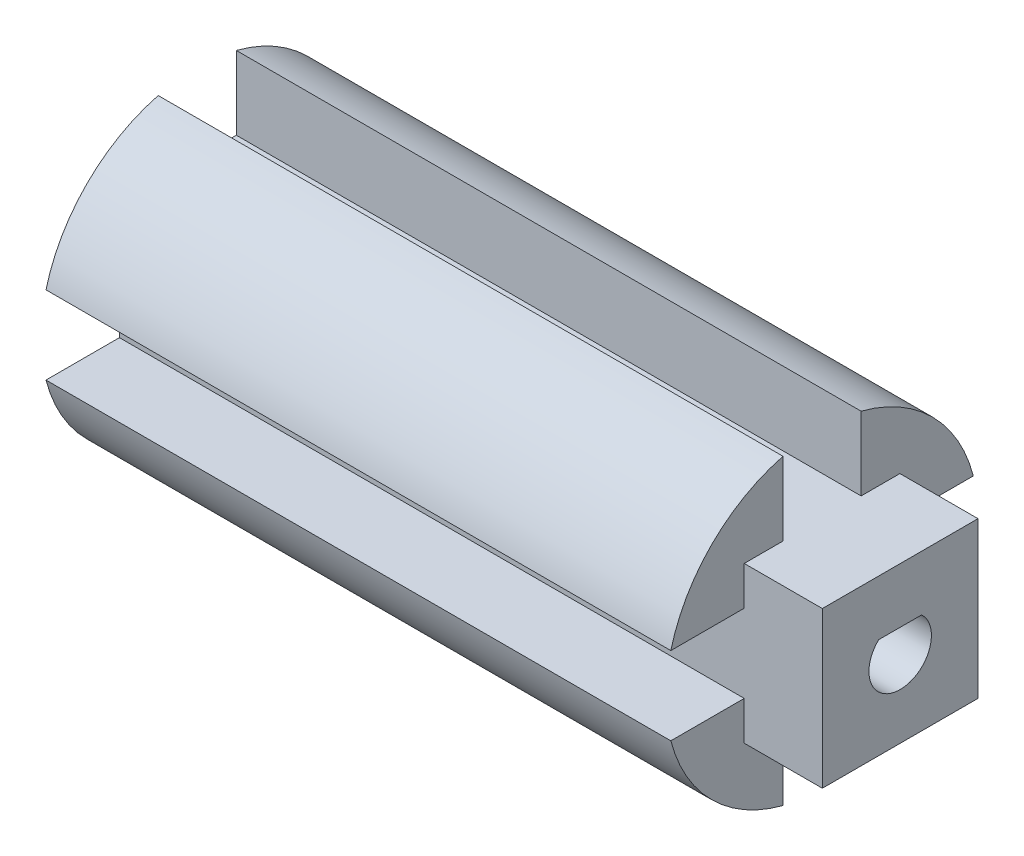
ISO-10303-21;
HEADER;
FILE_DESCRIPTION(('STEP AP214'),'2;1');
FILE_NAME('part.step','',(''),(''),'','','');
FILE_SCHEMA(('AUTOMOTIVE_DESIGN { 1 0 10303 214 1 1 1 1 }'));
ENDSEC;
DATA;
#1=APPLICATION_CONTEXT('core data for automotive mechanical design processes');
#2=APPLICATION_PROTOCOL_DEFINITION('international standard','automotive_design',2000,#1);
#3=PRODUCT_CONTEXT('',#1,'mechanical');
#4=PRODUCT('Part','Part','',(#3));
#5=PRODUCT_RELATED_PRODUCT_CATEGORY('part','',(#4));
#6=PRODUCT_DEFINITION_FORMATION('','',#4);
#7=PRODUCT_DEFINITION_CONTEXT('part definition',#1,'design');
#8=PRODUCT_DEFINITION('design','',#6,#7);
#9=PRODUCT_DEFINITION_SHAPE('','',#8);
#10=(LENGTH_UNIT() NAMED_UNIT(*) SI_UNIT(.MILLI.,.METRE.));
#11=(NAMED_UNIT(*) PLANE_ANGLE_UNIT() SI_UNIT($,.RADIAN.));
#12=(NAMED_UNIT(*) SI_UNIT($,.STERADIAN.) SOLID_ANGLE_UNIT());
#13=UNCERTAINTY_MEASURE_WITH_UNIT(LENGTH_MEASURE(1.E-05),#10,'distance_accuracy_value','');
#14=(GEOMETRIC_REPRESENTATION_CONTEXT(3) GLOBAL_UNCERTAINTY_ASSIGNED_CONTEXT((#13)) GLOBAL_UNIT_ASSIGNED_CONTEXT((#10,
#11,#12)) REPRESENTATION_CONTEXT('',''));
#15=CARTESIAN_POINT('',(0.,0.,0.));
#16=DIRECTION('',(0.,0.,1.));
#17=DIRECTION('',(1.,0.,0.));
#18=AXIS2_PLACEMENT_3D('',#15,#16,#17);
#19=CARTESIAN_POINT('',(90.,5.,0.));
#20=DIRECTION('',(0.,1.,0.));
#21=DIRECTION('',(0.,0.,1.));
#22=AXIS2_PLACEMENT_3D('',#19,#20,#21);
#23=PLANE('',#22);
#24=DIRECTION('',(0.,0.,-1.));
#25=VECTOR('',#24,1.);
#26=CARTESIAN_POINT('',(80.,5.,0.));
#27=LINE('',#26,#25);
#28=CARTESIAN_POINT('',(80.,5.,-9.96491673103709));
#29=VERTEX_POINT('',#28);
#30=CARTESIAN_POINT('',(80.,5.,-19.3649167310371));
#31=VERTEX_POINT('',#30);
#32=EDGE_CURVE('E199',#29,#31,#27,.T.);
#33=ORIENTED_EDGE('',*,*,#32,.F.);
#34=DIRECTION('',(-1.,0.,0.));
#35=VECTOR('',#34,1.);
#36=CARTESIAN_POINT('',(90.,5.,-9.96491673103709));
#37=LINE('',#36,#35);
#38=CARTESIAN_POINT('',(0.,5.,-9.96491673103709));
#39=VERTEX_POINT('',#38);
#40=EDGE_CURVE('E194',#29,#39,#37,.T.);
#41=ORIENTED_EDGE('',*,*,#40,.T.);
#42=DIRECTION('',(0.,0.,-1.));
#43=VECTOR('',#42,1.);
#44=CARTESIAN_POINT('',(0.,5.,0.));
#45=LINE('',#44,#43);
#46=CARTESIAN_POINT('',(0.,5.,-19.3649167310371));
#47=VERTEX_POINT('',#46);
#48=EDGE_CURVE('E302',#39,#47,#45,.T.);
#49=ORIENTED_EDGE('',*,*,#48,.T.);
#50=DIRECTION('',(-1.,0.,0.));
#51=VECTOR('',#50,1.);
#52=CARTESIAN_POINT('',(90.,5.,-19.3649167310371));
#53=LINE('',#52,#51);
#54=EDGE_CURVE('E11',#31,#47,#53,.T.);
#55=ORIENTED_EDGE('',*,*,#54,.F.);
#56=EDGE_LOOP('',(#33,#41,#49,#55));
#57=FACE_BOUND('',#56,.T.);
#58=ADVANCED_FACE('F40',(#57),#23,.F.);
#59=CARTESIAN_POINT('',(90.,0.,0.));
#60=DIRECTION('',(-1.,0.,0.));
#61=DIRECTION('',(0.,0.,1.));
#62=AXIS2_PLACEMENT_3D('',#59,#60,#61);
#63=CYLINDRICAL_SURFACE('',#62,20.);
#64=CARTESIAN_POINT('',(80.,0.,0.));
#65=DIRECTION('',(1.,0.,0.));
#66=DIRECTION('',(0.,0.,-1.));
#67=AXIS2_PLACEMENT_3D('',#64,#65,#66);
#68=CIRCLE('',#67,20.);
#69=CARTESIAN_POINT('',(80.,19.3649167310371,-5.));
#70=VERTEX_POINT('',#69);
#71=EDGE_CURVE('E225',#31,#70,#68,.T.);
#72=ORIENTED_EDGE('',*,*,#71,.F.);
#73=ORIENTED_EDGE('',*,*,#54,.T.);
#74=CARTESIAN_POINT('',(0.,0.,0.));
#75=DIRECTION('',(1.,0.,0.));
#76=DIRECTION('',(0.,0.,-1.));
#77=AXIS2_PLACEMENT_3D('',#74,#75,#76);
#78=CIRCLE('',#77,20.);
#79=CARTESIAN_POINT('',(0.,19.3649167310371,-5.));
#80=VERTEX_POINT('',#79);
#81=EDGE_CURVE('E319',#47,#80,#78,.T.);
#82=ORIENTED_EDGE('',*,*,#81,.T.);
#83=DIRECTION('',(-1.,0.,0.));
#84=VECTOR('',#83,1.);
#85=CARTESIAN_POINT('',(90.,19.3649167310371,-5.));
#86=LINE('',#85,#84);
#87=EDGE_CURVE('E48',#70,#80,#86,.T.);
#88=ORIENTED_EDGE('',*,*,#87,.F.);
#89=EDGE_LOOP('',(#72,#73,#82,#88));
#90=FACE_BOUND('',#89,.T.);
#91=ADVANCED_FACE('F417',(#90),#63,.T.);
#92=CARTESIAN_POINT('',(90.,0.,-5.));
#93=DIRECTION('',(0.,0.,1.));
#94=DIRECTION('',(0.,-1.,0.));
#95=AXIS2_PLACEMENT_3D('',#92,#93,#94);
#96=PLANE('',#95);
#97=DIRECTION('',(-1.,0.,0.));
#98=VECTOR('',#97,1.);
#99=CARTESIAN_POINT('',(90.,9.96491673103709,-5.));
#100=LINE('',#99,#98);
#101=CARTESIAN_POINT('',(80.,9.96491673103709,-5.));
#102=VERTEX_POINT('',#101);
#103=CARTESIAN_POINT('',(0.,9.96491673103709,-5.));
#104=VERTEX_POINT('',#103);
#105=EDGE_CURVE('E407',#102,#104,#100,.T.);
#106=ORIENTED_EDGE('',*,*,#105,.F.);
#107=DIRECTION('',(0.,-1.,0.));
#108=VECTOR('',#107,1.);
#109=CARTESIAN_POINT('',(80.,0.,-5.));
#110=LINE('',#109,#108);
#111=EDGE_CURVE('E211',#70,#102,#110,.T.);
#112=ORIENTED_EDGE('',*,*,#111,.F.);
#113=ORIENTED_EDGE('',*,*,#87,.T.);
#114=DIRECTION('',(0.,1.,0.));
#115=VECTOR('',#114,1.);
#116=CARTESIAN_POINT('',(0.,0.,-5.));
#117=LINE('',#116,#115);
#118=EDGE_CURVE('E323',#104,#80,#117,.T.);
#119=ORIENTED_EDGE('',*,*,#118,.F.);
#120=EDGE_LOOP('',(#106,#112,#113,#119));
#121=FACE_BOUND('',#120,.T.);
#122=ADVANCED_FACE('F413',(#121),#96,.T.);
#123=CARTESIAN_POINT('',(90.,0.,5.));
#124=DIRECTION('',(0.,0.,1.));
#125=DIRECTION('',(0.,-1.,0.));
#126=AXIS2_PLACEMENT_3D('',#123,#124,#125);
#127=PLANE('',#126);
#128=DIRECTION('',(0.,1.,0.));
#129=VECTOR('',#128,1.);
#130=CARTESIAN_POINT('',(80.,0.,5.));
#131=LINE('',#130,#129);
#132=CARTESIAN_POINT('',(80.,9.96491673103709,5.));
#133=VERTEX_POINT('',#132);
#134=CARTESIAN_POINT('',(80.,19.3649167310371,5.));
#135=VERTEX_POINT('',#134);
#136=EDGE_CURVE('E270',#133,#135,#131,.T.);
#137=ORIENTED_EDGE('',*,*,#136,.F.);
#138=DIRECTION('',(-1.,0.,0.));
#139=VECTOR('',#138,1.);
#140=CARTESIAN_POINT('',(90.,9.96491673103709,5.));
#141=LINE('',#140,#139);
#142=CARTESIAN_POINT('',(0.,9.96491673103709,5.));
#143=VERTEX_POINT('',#142);
#144=EDGE_CURVE('E404',#133,#143,#141,.T.);
#145=ORIENTED_EDGE('',*,*,#144,.T.);
#146=DIRECTION('',(0.,1.,0.));
#147=VECTOR('',#146,1.);
#148=CARTESIAN_POINT('',(0.,0.,5.));
#149=LINE('',#148,#147);
#150=CARTESIAN_POINT('',(0.,19.3649167310371,5.));
#151=VERTEX_POINT('',#150);
#152=EDGE_CURVE('E333',#143,#151,#149,.T.);
#153=ORIENTED_EDGE('',*,*,#152,.T.);
#154=DIRECTION('',(-1.,0.,0.));
#155=VECTOR('',#154,1.);
#156=CARTESIAN_POINT('',(90.,19.3649167310371,5.));
#157=LINE('',#156,#155);
#158=EDGE_CURVE('E401',#135,#151,#157,.T.);
#159=ORIENTED_EDGE('',*,*,#158,.F.);
#160=EDGE_LOOP('',(#137,#145,#153,#159));
#161=FACE_BOUND('',#160,.T.);
#162=ADVANCED_FACE('F428',(#161),#127,.F.);
#163=CARTESIAN_POINT('',(80.,0.,0.));
#164=DIRECTION('',(1.,0.,0.));
#165=DIRECTION('',(0.,0.,-1.));
#166=AXIS2_PLACEMENT_3D('',#163,#164,#165);
#167=CIRCLE('',#166,20.);
#168=CARTESIAN_POINT('',(80.,5.,19.3649167310371));
#169=VERTEX_POINT('',#168);
#170=EDGE_CURVE('E273',#135,#169,#167,.T.);
#171=ORIENTED_EDGE('',*,*,#170,.F.);
#172=ORIENTED_EDGE('',*,*,#158,.T.);
#173=CARTESIAN_POINT('',(0.,5.,19.3649167310371));
#174=VERTEX_POINT('',#173);
#175=EDGE_CURVE('E325',#151,#174,#78,.T.);
#176=ORIENTED_EDGE('',*,*,#175,.T.);
#177=DIRECTION('',(-1.,0.,0.));
#178=VECTOR('',#177,1.);
#179=CARTESIAN_POINT('',(90.,5.,19.3649167310371));
#180=LINE('',#179,#178);
#181=EDGE_CURVE('E398',#169,#174,#180,.T.);
#182=ORIENTED_EDGE('',*,*,#181,.F.);
#183=EDGE_LOOP('',(#171,#172,#176,#182));
#184=FACE_BOUND('',#183,.T.);
#185=ADVANCED_FACE('F437',(#184),#63,.T.);
#186=CARTESIAN_POINT('',(90.,5.,0.));
#187=DIRECTION('',(0.,1.,0.));
#188=DIRECTION('',(0.,0.,1.));
#189=AXIS2_PLACEMENT_3D('',#186,#187,#188);
#190=PLANE('',#189);
#191=DIRECTION('',(0.,0.,-1.));
#192=VECTOR('',#191,1.);
#193=CARTESIAN_POINT('',(80.,5.,0.));
#194=LINE('',#193,#192);
#195=CARTESIAN_POINT('',(80.,5.,9.96491673103709));
#196=VERTEX_POINT('',#195);
#197=EDGE_CURVE('E276',#169,#196,#194,.T.);
#198=ORIENTED_EDGE('',*,*,#197,.F.);
#199=ORIENTED_EDGE('',*,*,#181,.T.);
#200=DIRECTION('',(0.,0.,-1.));
#201=VECTOR('',#200,1.);
#202=CARTESIAN_POINT('',(0.,5.,0.));
#203=LINE('',#202,#201);
#204=CARTESIAN_POINT('',(0.,5.,9.96491673103709));
#205=VERTEX_POINT('',#204);
#206=EDGE_CURVE('E337',#174,#205,#203,.T.);
#207=ORIENTED_EDGE('',*,*,#206,.T.);
#208=DIRECTION('',(-1.,0.,0.));
#209=VECTOR('',#208,1.);
#210=CARTESIAN_POINT('',(90.,5.,9.96491673103709));
#211=LINE('',#210,#209);
#212=EDGE_CURVE('E395',#196,#205,#211,.T.);
#213=ORIENTED_EDGE('',*,*,#212,.F.);
#214=EDGE_LOOP('',(#198,#199,#207,#213));
#215=FACE_BOUND('',#214,.T.);
#216=ADVANCED_FACE('F441',(#215),#190,.F.);
#217=CARTESIAN_POINT('',(90.,-5.,0.));
#218=DIRECTION('',(0.,1.,0.));
#219=DIRECTION('',(0.,0.,1.));
#220=AXIS2_PLACEMENT_3D('',#217,#218,#219);
#221=PLANE('',#220);
#222=DIRECTION('',(-1.,0.,0.));
#223=VECTOR('',#222,1.);
#224=CARTESIAN_POINT('',(90.,-5.,19.3649167310371));
#225=LINE('',#224,#223);
#226=CARTESIAN_POINT('',(80.,-4.99999999999999,19.3649167310371));
#227=VERTEX_POINT('',#226);
#228=CARTESIAN_POINT('',(0.,-5.,19.3649167310371));
#229=VERTEX_POINT('',#228);
#230=EDGE_CURVE('E389',#227,#229,#225,.T.);
#231=ORIENTED_EDGE('',*,*,#230,.F.);
#232=DIRECTION('',(0.,0.,1.));
#233=VECTOR('',#232,1.);
#234=CARTESIAN_POINT('',(80.,-5.,0.));
#235=LINE('',#234,#233);
#236=CARTESIAN_POINT('',(80.,-5.,9.96491673103709));
#237=VERTEX_POINT('',#236);
#238=EDGE_CURVE('E252',#237,#227,#235,.T.);
#239=ORIENTED_EDGE('',*,*,#238,.F.);
#240=DIRECTION('',(-1.,0.,0.));
#241=VECTOR('',#240,1.);
#242=CARTESIAN_POINT('',(90.,-5.,9.96491673103709));
#243=LINE('',#242,#241);
#244=CARTESIAN_POINT('',(0.,-5.,9.96491673103709));
#245=VERTEX_POINT('',#244);
#246=EDGE_CURVE('E392',#237,#245,#243,.T.);
#247=ORIENTED_EDGE('',*,*,#246,.T.);
#248=DIRECTION('',(0.,0.,-1.));
#249=VECTOR('',#248,1.);
#250=CARTESIAN_POINT('',(0.,-5.,0.));
#251=LINE('',#250,#249);
#252=EDGE_CURVE('E345',#229,#245,#251,.T.);
#253=ORIENTED_EDGE('',*,*,#252,.F.);
#254=EDGE_LOOP('',(#231,#239,#247,#253));
#255=FACE_BOUND('',#254,.T.);
#256=ADVANCED_FACE('F486',(#255),#221,.T.);
#257=CARTESIAN_POINT('',(80.,0.,0.));
#258=DIRECTION('',(1.,0.,0.));
#259=DIRECTION('',(0.,0.,-1.));
#260=AXIS2_PLACEMENT_3D('',#257,#258,#259);
#261=CIRCLE('',#260,20.);
#262=CARTESIAN_POINT('',(80.,-19.3649167310371,5.));
#263=VERTEX_POINT('',#262);
#264=EDGE_CURVE('E255',#227,#263,#261,.T.);
#265=ORIENTED_EDGE('',*,*,#264,.F.);
#266=ORIENTED_EDGE('',*,*,#230,.T.);
#267=CARTESIAN_POINT('',(0.,-19.3649167310371,5.));
#268=VERTEX_POINT('',#267);
#269=EDGE_CURVE('E349',#229,#268,#78,.T.);
#270=ORIENTED_EDGE('',*,*,#269,.T.);
#271=DIRECTION('',(-1.,0.,0.));
#272=VECTOR('',#271,1.);
#273=CARTESIAN_POINT('',(90.,-19.3649167310371,5.));
#274=LINE('',#273,#272);
#275=EDGE_CURVE('E386',#263,#268,#274,.T.);
#276=ORIENTED_EDGE('',*,*,#275,.F.);
#277=EDGE_LOOP('',(#265,#266,#270,#276));
#278=FACE_BOUND('',#277,.T.);
#279=ADVANCED_FACE('F475',(#278),#63,.T.);
#280=CARTESIAN_POINT('',(90.,0.,5.));
#281=DIRECTION('',(0.,0.,1.));
#282=DIRECTION('',(0.,-1.,0.));
#283=AXIS2_PLACEMENT_3D('',#280,#281,#282);
#284=PLANE('',#283);
#285=DIRECTION('',(0.,1.,0.));
#286=VECTOR('',#285,1.);
#287=CARTESIAN_POINT('',(80.,0.,5.));
#288=LINE('',#287,#286);
#289=CARTESIAN_POINT('',(80.,-9.96491673103708,5.));
#290=VERTEX_POINT('',#289);
#291=EDGE_CURVE('E258',#263,#290,#288,.T.);
#292=ORIENTED_EDGE('',*,*,#291,.F.);
#293=ORIENTED_EDGE('',*,*,#275,.T.);
#294=DIRECTION('',(0.,1.,0.));
#295=VECTOR('',#294,1.);
#296=CARTESIAN_POINT('',(0.,0.,5.));
#297=LINE('',#296,#295);
#298=CARTESIAN_POINT('',(0.,-9.96491673103708,5.));
#299=VERTEX_POINT('',#298);
#300=EDGE_CURVE('E350',#268,#299,#297,.T.);
#301=ORIENTED_EDGE('',*,*,#300,.T.);
#302=DIRECTION('',(-1.,0.,0.));
#303=VECTOR('',#302,1.);
#304=CARTESIAN_POINT('',(90.,-9.96491673103708,5.));
#305=LINE('',#304,#303);
#306=EDGE_CURVE('E383',#290,#299,#305,.T.);
#307=ORIENTED_EDGE('',*,*,#306,.F.);
#308=EDGE_LOOP('',(#292,#293,#301,#307));
#309=FACE_BOUND('',#308,.T.);
#310=ADVANCED_FACE('F483',(#309),#284,.F.);
#311=CARTESIAN_POINT('',(90.,0.,-5.));
#312=DIRECTION('',(0.,0.,1.));
#313=DIRECTION('',(0.,-1.,0.));
#314=AXIS2_PLACEMENT_3D('',#311,#312,#313);
#315=PLANE('',#314);
#316=DIRECTION('',(-1.,0.,0.));
#317=VECTOR('',#316,1.);
#318=CARTESIAN_POINT('',(90.,-19.3649167310371,-5.));
#319=LINE('',#318,#317);
#320=CARTESIAN_POINT('',(80.,-19.3649167310371,-5.));
#321=VERTEX_POINT('',#320);
#322=CARTESIAN_POINT('',(0.,-19.3649167310371,-5.));
#323=VERTEX_POINT('',#322);
#324=EDGE_CURVE('E377',#321,#323,#319,.T.);
#325=ORIENTED_EDGE('',*,*,#324,.F.);
#326=DIRECTION('',(0.,-1.,0.));
#327=VECTOR('',#326,1.);
#328=CARTESIAN_POINT('',(80.,0.,-5.));
#329=LINE('',#328,#327);
#330=CARTESIAN_POINT('',(80.,-9.96491673103708,-5.));
#331=VERTEX_POINT('',#330);
#332=EDGE_CURVE('E237',#331,#321,#329,.T.);
#333=ORIENTED_EDGE('',*,*,#332,.F.);
#334=DIRECTION('',(-1.,0.,0.));
#335=VECTOR('',#334,1.);
#336=CARTESIAN_POINT('',(90.,-9.96491673103708,-5.));
#337=LINE('',#336,#335);
#338=CARTESIAN_POINT('',(0.,-9.96491673103708,-5.));
#339=VERTEX_POINT('',#338);
#340=EDGE_CURVE('E380',#331,#339,#337,.T.);
#341=ORIENTED_EDGE('',*,*,#340,.T.);
#342=DIRECTION('',(0.,1.,0.));
#343=VECTOR('',#342,1.);
#344=CARTESIAN_POINT('',(0.,0.,-5.));
#345=LINE('',#344,#343);
#346=EDGE_CURVE('E358',#323,#339,#345,.T.);
#347=ORIENTED_EDGE('',*,*,#346,.F.);
#348=EDGE_LOOP('',(#325,#333,#341,#347));
#349=FACE_BOUND('',#348,.T.);
#350=ADVANCED_FACE('F477',(#349),#315,.T.);
#351=CARTESIAN_POINT('',(80.,0.,0.));
#352=DIRECTION('',(1.,0.,0.));
#353=DIRECTION('',(0.,0.,-1.));
#354=AXIS2_PLACEMENT_3D('',#351,#352,#353);
#355=CIRCLE('',#354,20.);
#356=CARTESIAN_POINT('',(80.,-5.,-19.3649167310371));
#357=VERTEX_POINT('',#356);
#358=EDGE_CURVE('E240',#321,#357,#355,.T.);
#359=ORIENTED_EDGE('',*,*,#358,.F.);
#360=ORIENTED_EDGE('',*,*,#324,.T.);
#361=CARTESIAN_POINT('',(0.,-5.,-19.3649167310371));
#362=VERTEX_POINT('',#361);
#363=EDGE_CURVE('E324',#323,#362,#78,.T.);
#364=ORIENTED_EDGE('',*,*,#363,.T.);
#365=DIRECTION('',(-1.,0.,0.));
#366=VECTOR('',#365,1.);
#367=CARTESIAN_POINT('',(90.,-5.,-19.3649167310371));
#368=LINE('',#367,#366);
#369=EDGE_CURVE('E374',#357,#362,#368,.T.);
#370=ORIENTED_EDGE('',*,*,#369,.F.);
#371=EDGE_LOOP('',(#359,#360,#364,#370));
#372=FACE_BOUND('',#371,.T.);
#373=ADVANCED_FACE('F468',(#372),#63,.T.);
#374=CARTESIAN_POINT('',(90.,-5.,0.));
#375=DIRECTION('',(0.,1.,0.));
#376=DIRECTION('',(0.,0.,1.));
#377=AXIS2_PLACEMENT_3D('',#374,#375,#376);
#378=PLANE('',#377);
#379=DIRECTION('',(-1.,0.,0.));
#380=VECTOR('',#379,1.);
#381=CARTESIAN_POINT('',(90.,-5.,-9.96491673103709));
#382=LINE('',#381,#380);
#383=CARTESIAN_POINT('',(80.,-5.,-9.96491673103709));
#384=VERTEX_POINT('',#383);
#385=CARTESIAN_POINT('',(0.,-5.,-9.96491673103709));
#386=VERTEX_POINT('',#385);
#387=EDGE_CURVE('E371',#384,#386,#382,.T.);
#388=ORIENTED_EDGE('',*,*,#387,.F.);
#389=DIRECTION('',(0.,0.,1.));
#390=VECTOR('',#389,1.);
#391=CARTESIAN_POINT('',(80.,-5.,0.));
#392=LINE('',#391,#390);
#393=EDGE_CURVE('E220',#357,#384,#392,.T.);
#394=ORIENTED_EDGE('',*,*,#393,.F.);
#395=ORIENTED_EDGE('',*,*,#369,.T.);
#396=DIRECTION('',(0.,0.,-1.));
#397=VECTOR('',#396,1.);
#398=CARTESIAN_POINT('',(0.,-5.,0.));
#399=LINE('',#398,#397);
#400=EDGE_CURVE('E362',#386,#362,#399,.T.);
#401=ORIENTED_EDGE('',*,*,#400,.F.);
#402=EDGE_LOOP('',(#388,#394,#395,#401));
#403=FACE_BOUND('',#402,.T.);
#404=ADVANCED_FACE('F460',(#403),#378,.T.);
#405=CARTESIAN_POINT('',(90.,0.,0.));
#406=DIRECTION('',(1.,0.,0.));
#407=DIRECTION('',(0.,0.,-1.));
#408=AXIS2_PLACEMENT_3D('',#405,#406,#407);
#409=PLANE('',#408);
#410=CARTESIAN_POINT('',(90.,0.,0.));
#411=DIRECTION('',(1.,0.,0.));
#412=DIRECTION('',(0.,0.,-1.));
#413=AXIS2_PLACEMENT_3D('',#410,#411,#412);
#414=CIRCLE('',#413,4.);
#415=CARTESIAN_POINT('',(90.,2.9,2.75499546279118));
#416=VERTEX_POINT('',#415);
#417=CARTESIAN_POINT('',(90.,2.9,-2.75499546279118));
#418=VERTEX_POINT('',#417);
#419=EDGE_CURVE('E283',#416,#418,#414,.T.);
#420=ORIENTED_EDGE('',*,*,#419,.F.);
#421=DIRECTION('',(0.,0.,1.));
#422=VECTOR('',#421,1.);
#423=CARTESIAN_POINT('',(90.,2.9,2.75499546279118));
#424=LINE('',#423,#422);
#425=EDGE_CURVE('E289',#418,#416,#424,.T.);
#426=ORIENTED_EDGE('',*,*,#425,.F.);
#427=EDGE_LOOP('',(#420,#426));
#428=FACE_BOUND('',#427,.T.);
#429=DIRECTION('',(0.,-1.,0.));
#430=VECTOR('',#429,1.);
#431=CARTESIAN_POINT('',(90.,0.,9.96491673103709));
#432=LINE('',#431,#430);
#433=CARTESIAN_POINT('',(90.,9.96491673103709,9.96491673103709));
#434=VERTEX_POINT('',#433);
#435=CARTESIAN_POINT('',(90.,-9.96491673103708,9.96491673103709));
#436=VERTEX_POINT('',#435);
#437=EDGE_CURVE('E308',#434,#436,#432,.T.);
#438=ORIENTED_EDGE('',*,*,#437,.T.);
#439=DIRECTION('',(0.,0.,-1.));
#440=VECTOR('',#439,1.);
#441=CARTESIAN_POINT('',(90.,-9.96491673103708,0.));
#442=LINE('',#441,#440);
#443=CARTESIAN_POINT('',(90.,-9.96491673103708,-9.96491673103709));
#444=VERTEX_POINT('',#443);
#445=EDGE_CURVE('E55',#436,#444,#442,.T.);
#446=ORIENTED_EDGE('',*,*,#445,.T.);
#447=DIRECTION('',(0.,-1.,0.));
#448=VECTOR('',#447,1.);
#449=CARTESIAN_POINT('',(90.,0.,-9.96491673103709));
#450=LINE('',#449,#448);
#451=CARTESIAN_POINT('',(90.,9.96491673103709,-9.96491673103709));
#452=VERTEX_POINT('',#451);
#453=EDGE_CURVE('E63',#452,#444,#450,.T.);
#454=ORIENTED_EDGE('',*,*,#453,.F.);
#455=DIRECTION('',(0.,0.,-1.));
#456=VECTOR('',#455,1.);
#457=CARTESIAN_POINT('',(90.,9.96491673103709,0.));
#458=LINE('',#457,#456);
#459=EDGE_CURVE('E208',#434,#452,#458,.T.);
#460=ORIENTED_EDGE('',*,*,#459,.F.);
#461=EDGE_LOOP('',(#438,#446,#454,#460));
#462=FACE_BOUND('',#461,.T.);
#463=ADVANCED_FACE('F447',(#428,#462),#409,.T.);
#464=CARTESIAN_POINT('',(90.,9.96491673103709,0.));
#465=DIRECTION('',(0.,1.,0.));
#466=DIRECTION('',(0.,0.,1.));
#467=AXIS2_PLACEMENT_3D('',#464,#465,#466);
#468=PLANE('',#467);
#469=DIRECTION('',(0.,0.,-1.));
#470=VECTOR('',#469,1.);
#471=CARTESIAN_POINT('',(0.,9.96491673103709,0.));
#472=LINE('',#471,#470);
#473=EDGE_CURVE('E329',#143,#104,#472,.T.);
#474=ORIENTED_EDGE('',*,*,#473,.F.);
#475=ORIENTED_EDGE('',*,*,#144,.F.);
#476=DIRECTION('',(0.,0.,1.));
#477=VECTOR('',#476,1.);
#478=CARTESIAN_POINT('',(80.,9.96491673103709,0.));
#479=LINE('',#478,#477);
#480=CARTESIAN_POINT('',(80.,9.96491673103709,9.96491673103709));
#481=VERTEX_POINT('',#480);
#482=EDGE_CURVE('E267',#133,#481,#479,.T.);
#483=ORIENTED_EDGE('',*,*,#482,.T.);
#484=DIRECTION('',(1.,0.,0.));
#485=VECTOR('',#484,1.);
#486=CARTESIAN_POINT('',(80.,9.96491673103709,9.96491673103709));
#487=LINE('',#486,#485);
#488=EDGE_CURVE('E280',#481,#434,#487,.T.);
#489=ORIENTED_EDGE('',*,*,#488,.T.);
#490=ORIENTED_EDGE('',*,*,#459,.T.);
#491=DIRECTION('',(1.,0.,0.));
#492=VECTOR('',#491,1.);
#493=CARTESIAN_POINT('',(80.,9.96491673103709,-9.96491673103709));
#494=LINE('',#493,#492);
#495=CARTESIAN_POINT('',(80.,9.96491673103709,-9.96491673103709));
#496=VERTEX_POINT('',#495);
#497=EDGE_CURVE('E193',#496,#452,#494,.T.);
#498=ORIENTED_EDGE('',*,*,#497,.F.);
#499=DIRECTION('',(0.,0.,1.));
#500=VECTOR('',#499,1.);
#501=CARTESIAN_POINT('',(80.,9.96491673103709,0.));
#502=LINE('',#501,#500);
#503=EDGE_CURVE('E200',#496,#102,#502,.T.);
#504=ORIENTED_EDGE('',*,*,#503,.T.);
#505=ORIENTED_EDGE('',*,*,#105,.T.);
#506=EDGE_LOOP('',(#474,#475,#483,#489,#490,#498,#504,#505));
#507=FACE_BOUND('',#506,.T.);
#508=ADVANCED_FACE('F204',(#507),#468,.T.);
#509=CARTESIAN_POINT('',(90.,0.,9.96491673103709));
#510=DIRECTION('',(0.,0.,-1.));
#511=DIRECTION('',(-1.,0.,0.));
#512=AXIS2_PLACEMENT_3D('',#509,#510,#511);
#513=PLANE('',#512);
#514=DIRECTION('',(0.,-1.,0.));
#515=VECTOR('',#514,1.);
#516=CARTESIAN_POINT('',(0.,0.,9.96491673103709));
#517=LINE('',#516,#515);
#518=EDGE_CURVE('E341',#205,#245,#517,.T.);
#519=ORIENTED_EDGE('',*,*,#518,.T.);
#520=ORIENTED_EDGE('',*,*,#246,.F.);
#521=DIRECTION('',(0.,-1.,0.));
#522=VECTOR('',#521,1.);
#523=CARTESIAN_POINT('',(80.,0.,9.96491673103709));
#524=LINE('',#523,#522);
#525=CARTESIAN_POINT('',(80.,-9.96491673103708,9.96491673103709));
#526=VERTEX_POINT('',#525);
#527=EDGE_CURVE('E249',#237,#526,#524,.T.);
#528=ORIENTED_EDGE('',*,*,#527,.T.);
#529=DIRECTION('',(1.,0.,0.));
#530=VECTOR('',#529,1.);
#531=CARTESIAN_POINT('',(80.,-9.96491673103708,9.96491673103709));
#532=LINE('',#531,#530);
#533=EDGE_CURVE('E234',#526,#436,#532,.T.);
#534=ORIENTED_EDGE('',*,*,#533,.T.);
#535=ORIENTED_EDGE('',*,*,#437,.F.);
#536=ORIENTED_EDGE('',*,*,#488,.F.);
#537=DIRECTION('',(0.,-1.,0.));
#538=VECTOR('',#537,1.);
#539=CARTESIAN_POINT('',(80.,0.,9.96491673103709));
#540=LINE('',#539,#538);
#541=EDGE_CURVE('E210',#481,#196,#540,.T.);
#542=ORIENTED_EDGE('',*,*,#541,.T.);
#543=ORIENTED_EDGE('',*,*,#212,.T.);
#544=EDGE_LOOP('',(#519,#520,#528,#534,#535,#536,#542,#543));
#545=FACE_BOUND('',#544,.T.);
#546=ADVANCED_FACE('F445',(#545),#513,.F.);
#547=CARTESIAN_POINT('',(90.,-9.96491673103708,0.));
#548=DIRECTION('',(0.,1.,0.));
#549=DIRECTION('',(0.,0.,1.));
#550=AXIS2_PLACEMENT_3D('',#547,#548,#549);
#551=PLANE('',#550);
#552=DIRECTION('',(0.,0.,-1.));
#553=VECTOR('',#552,1.);
#554=CARTESIAN_POINT('',(0.,-9.96491673103708,0.));
#555=LINE('',#554,#553);
#556=EDGE_CURVE('E354',#299,#339,#555,.T.);
#557=ORIENTED_EDGE('',*,*,#556,.T.);
#558=ORIENTED_EDGE('',*,*,#340,.F.);
#559=DIRECTION('',(0.,0.,-1.));
#560=VECTOR('',#559,1.);
#561=CARTESIAN_POINT('',(80.,-9.96491673103708,0.));
#562=LINE('',#561,#560);
#563=CARTESIAN_POINT('',(80.,-9.96491673103708,-9.96491673103709));
#564=VERTEX_POINT('',#563);
#565=EDGE_CURVE('E233',#331,#564,#562,.T.);
#566=ORIENTED_EDGE('',*,*,#565,.T.);
#567=DIRECTION('',(1.,0.,0.));
#568=VECTOR('',#567,1.);
#569=CARTESIAN_POINT('',(80.,-9.96491673103708,-9.96491673103709));
#570=LINE('',#569,#568);
#571=EDGE_CURVE('E217',#564,#444,#570,.T.);
#572=ORIENTED_EDGE('',*,*,#571,.T.);
#573=ORIENTED_EDGE('',*,*,#445,.F.);
#574=ORIENTED_EDGE('',*,*,#533,.F.);
#575=DIRECTION('',(0.,0.,-1.));
#576=VECTOR('',#575,1.);
#577=CARTESIAN_POINT('',(80.,-9.96491673103708,0.));
#578=LINE('',#577,#576);
#579=EDGE_CURVE('E246',#526,#290,#578,.T.);
#580=ORIENTED_EDGE('',*,*,#579,.T.);
#581=ORIENTED_EDGE('',*,*,#306,.T.);
#582=EDGE_LOOP('',(#557,#558,#566,#572,#573,#574,#580,#581));
#583=FACE_BOUND('',#582,.T.);
#584=ADVANCED_FACE('F448',(#583),#551,.F.);
#585=CARTESIAN_POINT('',(90.,0.,-9.96491673103709));
#586=DIRECTION('',(0.,0.,-1.));
#587=DIRECTION('',(0.,1.,0.));
#588=AXIS2_PLACEMENT_3D('',#585,#586,#587);
#589=PLANE('',#588);
#590=DIRECTION('',(0.,-1.,0.));
#591=VECTOR('',#590,1.);
#592=CARTESIAN_POINT('',(0.,0.,-9.96491673103709));
#593=LINE('',#592,#591);
#594=EDGE_CURVE('E309',#39,#386,#593,.T.);
#595=ORIENTED_EDGE('',*,*,#594,.F.);
#596=ORIENTED_EDGE('',*,*,#40,.F.);
#597=DIRECTION('',(0.,1.,0.));
#598=VECTOR('',#597,1.);
#599=CARTESIAN_POINT('',(80.,0.,-9.96491673103709));
#600=LINE('',#599,#598);
#601=EDGE_CURVE('E189',#29,#496,#600,.T.);
#602=ORIENTED_EDGE('',*,*,#601,.T.);
#603=ORIENTED_EDGE('',*,*,#497,.T.);
#604=ORIENTED_EDGE('',*,*,#453,.T.);
#605=ORIENTED_EDGE('',*,*,#571,.F.);
#606=DIRECTION('',(0.,1.,0.));
#607=VECTOR('',#606,1.);
#608=CARTESIAN_POINT('',(80.,0.,-9.96491673103709));
#609=LINE('',#608,#607);
#610=EDGE_CURVE('E230',#564,#384,#609,.T.);
#611=ORIENTED_EDGE('',*,*,#610,.T.);
#612=ORIENTED_EDGE('',*,*,#387,.T.);
#613=EDGE_LOOP('',(#595,#596,#602,#603,#604,#605,#611,#612));
#614=FACE_BOUND('',#613,.T.);
#615=ADVANCED_FACE('F192',(#614),#589,.T.);
#616=CARTESIAN_POINT('',(0.,0.,0.));
#617=DIRECTION('',(1.,0.,0.));
#618=DIRECTION('',(0.,0.,-1.));
#619=AXIS2_PLACEMENT_3D('',#616,#617,#618);
#620=PLANE('',#619);
#621=ORIENTED_EDGE('',*,*,#48,.F.);
#622=ORIENTED_EDGE('',*,*,#594,.T.);
#623=ORIENTED_EDGE('',*,*,#400,.T.);
#624=ORIENTED_EDGE('',*,*,#363,.F.);
#625=ORIENTED_EDGE('',*,*,#346,.T.);
#626=ORIENTED_EDGE('',*,*,#556,.F.);
#627=ORIENTED_EDGE('',*,*,#300,.F.);
#628=ORIENTED_EDGE('',*,*,#269,.F.);
#629=ORIENTED_EDGE('',*,*,#252,.T.);
#630=ORIENTED_EDGE('',*,*,#518,.F.);
#631=ORIENTED_EDGE('',*,*,#206,.F.);
#632=ORIENTED_EDGE('',*,*,#175,.F.);
#633=ORIENTED_EDGE('',*,*,#152,.F.);
#634=ORIENTED_EDGE('',*,*,#473,.T.);
#635=ORIENTED_EDGE('',*,*,#118,.T.);
#636=ORIENTED_EDGE('',*,*,#81,.F.);
#637=EDGE_LOOP('',(#621,#622,#623,#624,#625,#626,#627,#628,#629,#630,#631,#632,#633,#634,#635,#636));
#638=FACE_BOUND('',#637,.T.);
#639=ADVANCED_FACE('F421',(#638),#620,.F.);
#640=CARTESIAN_POINT('',(72.,0.,0.));
#641=DIRECTION('',(1.,0.,0.));
#642=DIRECTION('',(0.,0.,-1.));
#643=AXIS2_PLACEMENT_3D('',#640,#641,#642);
#644=CYLINDRICAL_SURFACE('',#643,4.);
#645=ORIENTED_EDGE('',*,*,#419,.T.);
#646=DIRECTION('',(1.,0.,0.));
#647=VECTOR('',#646,1.);
#648=CARTESIAN_POINT('',(72.,2.9,-2.75499546279118));
#649=LINE('',#648,#647);
#650=CARTESIAN_POINT('',(72.,2.9,-2.75499546279118));
#651=VERTEX_POINT('',#650);
#652=EDGE_CURVE('E293',#651,#418,#649,.T.);
#653=ORIENTED_EDGE('',*,*,#652,.F.);
#654=CARTESIAN_POINT('',(72.,0.,0.));
#655=DIRECTION('',(1.,0.,0.));
#656=DIRECTION('',(0.,0.,-1.));
#657=AXIS2_PLACEMENT_3D('',#654,#655,#656);
#658=CIRCLE('',#657,4.);
#659=CARTESIAN_POINT('',(72.,2.9,2.75499546279118));
#660=VERTEX_POINT('',#659);
#661=EDGE_CURVE('E284',#660,#651,#658,.T.);
#662=ORIENTED_EDGE('',*,*,#661,.F.);
#663=DIRECTION('',(1.,0.,0.));
#664=VECTOR('',#663,1.);
#665=CARTESIAN_POINT('',(72.,2.9,2.75499546279118));
#666=LINE('',#665,#664);
#667=EDGE_CURVE('E299',#660,#416,#666,.T.);
#668=ORIENTED_EDGE('',*,*,#667,.T.);
#669=EDGE_LOOP('',(#645,#653,#662,#668));
#670=FACE_BOUND('',#669,.T.);
#671=ADVANCED_FACE('F534',(#670),#644,.F.);
#672=CARTESIAN_POINT('',(72.,2.9,2.75499546279118));
#673=DIRECTION('',(0.,1.,0.));
#674=DIRECTION('',(0.,0.,1.));
#675=AXIS2_PLACEMENT_3D('',#672,#673,#674);
#676=PLANE('',#675);
#677=ORIENTED_EDGE('',*,*,#425,.T.);
#678=ORIENTED_EDGE('',*,*,#667,.F.);
#679=DIRECTION('',(0.,0.,1.));
#680=VECTOR('',#679,1.);
#681=CARTESIAN_POINT('',(72.,2.9,2.75499546279118));
#682=LINE('',#681,#680);
#683=EDGE_CURVE('E288',#651,#660,#682,.T.);
#684=ORIENTED_EDGE('',*,*,#683,.F.);
#685=ORIENTED_EDGE('',*,*,#652,.T.);
#686=EDGE_LOOP('',(#677,#678,#684,#685));
#687=FACE_BOUND('',#686,.T.);
#688=ADVANCED_FACE('F530',(#687),#676,.F.);
#689=CARTESIAN_POINT('',(72.,0.,0.));
#690=DIRECTION('',(1.,0.,0.));
#691=DIRECTION('',(0.,0.,-1.));
#692=AXIS2_PLACEMENT_3D('',#689,#690,#691);
#693=PLANE('',#692);
#694=ORIENTED_EDGE('',*,*,#661,.T.);
#695=ORIENTED_EDGE('',*,*,#683,.T.);
#696=EDGE_LOOP('',(#694,#695));
#697=FACE_BOUND('',#696,.T.);
#698=ADVANCED_FACE('F527',(#697),#693,.T.);
#699=CARTESIAN_POINT('',(80.,0.,0.));
#700=DIRECTION('',(1.,0.,0.));
#701=DIRECTION('',(0.,0.,-1.));
#702=AXIS2_PLACEMENT_3D('',#699,#700,#701);
#703=PLANE('',#702);
#704=ORIENTED_EDGE('',*,*,#541,.F.);
#705=ORIENTED_EDGE('',*,*,#482,.F.);
#706=ORIENTED_EDGE('',*,*,#136,.T.);
#707=ORIENTED_EDGE('',*,*,#170,.T.);
#708=ORIENTED_EDGE('',*,*,#197,.T.);
#709=EDGE_LOOP('',(#704,#705,#706,#707,#708));
#710=FACE_BOUND('',#709,.T.);
#711=ADVANCED_FACE('F433',(#710),#703,.T.);
#712=CARTESIAN_POINT('',(80.,0.,0.));
#713=DIRECTION('',(1.,0.,0.));
#714=DIRECTION('',(0.,0.,-1.));
#715=AXIS2_PLACEMENT_3D('',#712,#713,#714);
#716=PLANE('',#715);
#717=ORIENTED_EDGE('',*,*,#503,.F.);
#718=ORIENTED_EDGE('',*,*,#601,.F.);
#719=ORIENTED_EDGE('',*,*,#32,.T.);
#720=ORIENTED_EDGE('',*,*,#71,.T.);
#721=ORIENTED_EDGE('',*,*,#111,.T.);
#722=EDGE_LOOP('',(#717,#718,#719,#720,#721));
#723=FACE_BOUND('',#722,.T.);
#724=ADVANCED_FACE('F213',(#723),#716,.T.);
#725=CARTESIAN_POINT('',(80.,0.,0.));
#726=DIRECTION('',(1.,0.,0.));
#727=DIRECTION('',(0.,0.,-1.));
#728=AXIS2_PLACEMENT_3D('',#725,#726,#727);
#729=PLANE('',#728);
#730=ORIENTED_EDGE('',*,*,#610,.F.);
#731=ORIENTED_EDGE('',*,*,#565,.F.);
#732=ORIENTED_EDGE('',*,*,#332,.T.);
#733=ORIENTED_EDGE('',*,*,#358,.T.);
#734=ORIENTED_EDGE('',*,*,#393,.T.);
#735=EDGE_LOOP('',(#730,#731,#732,#733,#734));
#736=FACE_BOUND('',#735,.T.);
#737=ADVANCED_FACE('F452',(#736),#729,.T.);
#738=CARTESIAN_POINT('',(80.,0.,0.));
#739=DIRECTION('',(1.,0.,0.));
#740=DIRECTION('',(0.,0.,-1.));
#741=AXIS2_PLACEMENT_3D('',#738,#739,#740);
#742=PLANE('',#741);
#743=ORIENTED_EDGE('',*,*,#579,.F.);
#744=ORIENTED_EDGE('',*,*,#527,.F.);
#745=ORIENTED_EDGE('',*,*,#238,.T.);
#746=ORIENTED_EDGE('',*,*,#264,.T.);
#747=ORIENTED_EDGE('',*,*,#291,.T.);
#748=EDGE_LOOP('',(#743,#744,#745,#746,#747));
#749=FACE_BOUND('',#748,.T.);
#750=ADVANCED_FACE('F516',(#749),#742,.T.);
#751=CLOSED_SHELL('',(#58,#91,#122,#162,#185,#216,#256,#279,#310,#350,#373,#404,#463,#508,#546,
#584,#615,#639,#671,#688,#698,#711,#724,#737,#750));
#752=MANIFOLD_SOLID_BREP('B2',#751);
#753=ADVANCED_BREP_SHAPE_REPRESENTATION('',(#18,#752),#14);
#754=SHAPE_DEFINITION_REPRESENTATION(#9,#753);
ENDSEC;
END-ISO-10303-21;
